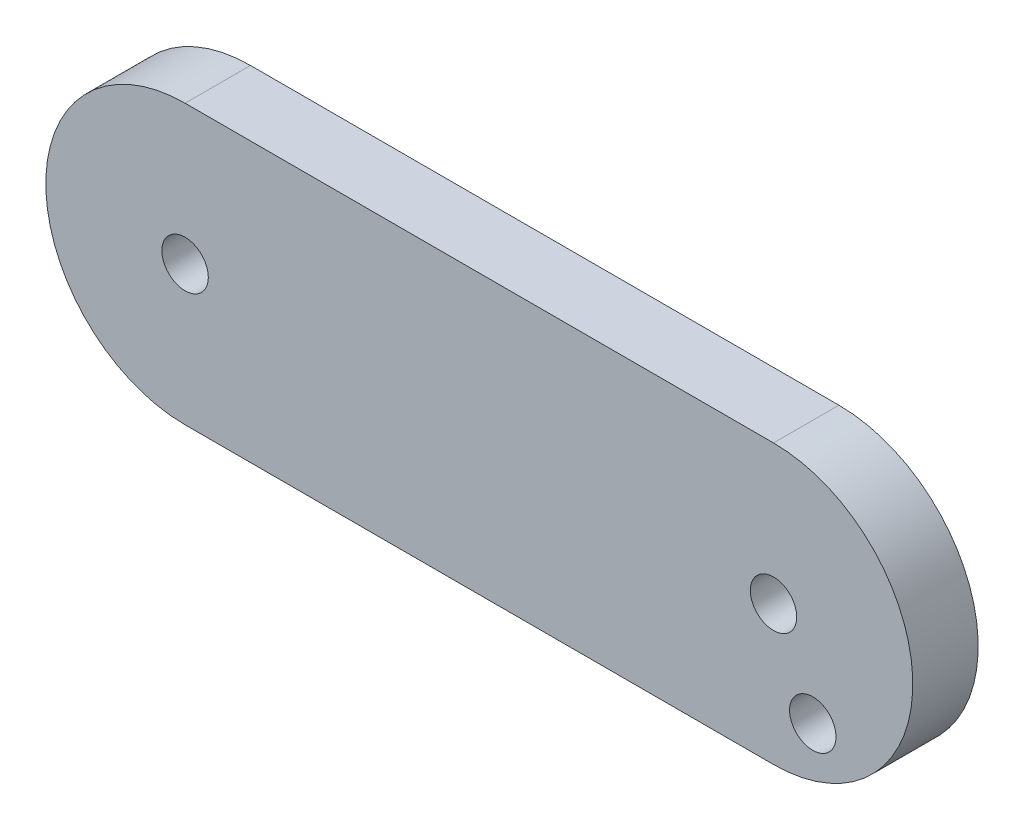
ISO-10303-21;
HEADER;
FILE_DESCRIPTION(('STEP AP214'),'2;1');
FILE_NAME('part.step','',(''),(''),'','','');
FILE_SCHEMA(('AUTOMOTIVE_DESIGN { 1 0 10303 214 1 1 1 1 }'));
ENDSEC;
DATA;
#1=APPLICATION_CONTEXT('core data for automotive mechanical design processes');
#2=APPLICATION_PROTOCOL_DEFINITION('international standard','automotive_design',2000,#1);
#3=PRODUCT_CONTEXT('',#1,'mechanical');
#4=PRODUCT('Part','Part','',(#3));
#5=PRODUCT_RELATED_PRODUCT_CATEGORY('part','',(#4));
#6=PRODUCT_DEFINITION_FORMATION('','',#4);
#7=PRODUCT_DEFINITION_CONTEXT('part definition',#1,'design');
#8=PRODUCT_DEFINITION('design','',#6,#7);
#9=PRODUCT_DEFINITION_SHAPE('','',#8);
#10=(LENGTH_UNIT() NAMED_UNIT(*) SI_UNIT(.MILLI.,.METRE.));
#11=(NAMED_UNIT(*) PLANE_ANGLE_UNIT() SI_UNIT($,.RADIAN.));
#12=(NAMED_UNIT(*) SI_UNIT($,.STERADIAN.) SOLID_ANGLE_UNIT());
#13=UNCERTAINTY_MEASURE_WITH_UNIT(LENGTH_MEASURE(1.E-05),#10,'distance_accuracy_value','');
#14=(GEOMETRIC_REPRESENTATION_CONTEXT(3) GLOBAL_UNCERTAINTY_ASSIGNED_CONTEXT((#13)) GLOBAL_UNIT_ASSIGNED_CONTEXT((#10,
#11,#12)) REPRESENTATION_CONTEXT('',''));
#15=CARTESIAN_POINT('',(0.,0.,0.));
#16=DIRECTION('',(0.,0.,1.));
#17=DIRECTION('',(1.,0.,0.));
#18=AXIS2_PLACEMENT_3D('',#15,#16,#17);
#19=CARTESIAN_POINT('',(-22.5,-1.59594559789866E-13,570.51928881621));
#20=DIRECTION('',(0.,0.,1.));
#21=DIRECTION('',(1.,0.,0.));
#22=AXIS2_PLACEMENT_3D('',#19,#20,#21);
#23=PLANE('',#22);
#24=CARTESIAN_POINT('',(1.50100101049646,-3.21706325188511,570.51928881621));
#25=DIRECTION('',(0.,0.,-1.));
#26=DIRECTION('',(-1.,0.,0.));
#27=AXIS2_PLACEMENT_3D('',#24,#25,#26);
#28=CIRCLE('',#27,0.887499999999999);
#29=CARTESIAN_POINT('',(0.61350101049646,-3.21706325188511,570.51928881621));
#30=VERTEX_POINT('',#29);
#31=EDGE_CURVE('E148',#30,#30,#28,.T.);
#32=ORIENTED_EDGE('',*,*,#31,.T.);
#33=EDGE_LOOP('',(#32));
#34=FACE_BOUND('',#33,.T.);
#35=CARTESIAN_POINT('',(0.,0.,570.51928881621));
#36=DIRECTION('',(0.,0.,1.));
#37=DIRECTION('',(1.,0.,0.));
#38=AXIS2_PLACEMENT_3D('',#35,#36,#37);
#39=CIRCLE('',#38,0.887499999999997);
#40=CARTESIAN_POINT('',(0.887499999999997,0.,570.51928881621));
#41=VERTEX_POINT('',#40);
#42=EDGE_CURVE('E118',#41,#41,#39,.T.);
#43=ORIENTED_EDGE('',*,*,#42,.F.);
#44=EDGE_LOOP('',(#43));
#45=FACE_BOUND('',#44,.T.);
#46=CARTESIAN_POINT('',(-22.5,-1.59594559789866E-13,570.51928881621));
#47=DIRECTION('',(0.,0.,1.));
#48=DIRECTION('',(1.,0.,0.));
#49=AXIS2_PLACEMENT_3D('',#46,#47,#48);
#50=CIRCLE('',#49,5.32499999999984);
#51=CARTESIAN_POINT('',(-22.5,5.32499999999984,570.51928881621));
#52=VERTEX_POINT('',#51);
#53=CARTESIAN_POINT('',(-22.5,-5.32499999999984,570.51928881621));
#54=VERTEX_POINT('',#53);
#55=EDGE_CURVE('E98',#52,#54,#50,.T.);
#56=ORIENTED_EDGE('',*,*,#55,.T.);
#57=DIRECTION('',(1.,0.,0.));
#58=VECTOR('',#57,1.);
#59=CARTESIAN_POINT('',(-22.5,-5.32499999999984,570.51928881621));
#60=LINE('',#59,#58);
#61=CARTESIAN_POINT('',(0.,-5.32499999999984,570.51928881621));
#62=VERTEX_POINT('',#61);
#63=EDGE_CURVE('E93',#54,#62,#60,.T.);
#64=ORIENTED_EDGE('',*,*,#63,.T.);
#65=CARTESIAN_POINT('',(0.,0.,570.51928881621));
#66=DIRECTION('',(0.,0.,1.));
#67=DIRECTION('',(1.,0.,0.));
#68=AXIS2_PLACEMENT_3D('',#65,#66,#67);
#69=CIRCLE('',#68,5.32499999999984);
#70=CARTESIAN_POINT('',(0.,5.32499999999984,570.51928881621));
#71=VERTEX_POINT('',#70);
#72=EDGE_CURVE('E96',#62,#71,#69,.T.);
#73=ORIENTED_EDGE('',*,*,#72,.T.);
#74=DIRECTION('',(-1.,0.,0.));
#75=VECTOR('',#74,1.);
#76=CARTESIAN_POINT('',(-22.5,5.32499999999984,570.51928881621));
#77=LINE('',#76,#75);
#78=EDGE_CURVE('E63',#71,#52,#77,.T.);
#79=ORIENTED_EDGE('',*,*,#78,.T.);
#80=EDGE_LOOP('',(#56,#64,#73,#79));
#81=FACE_BOUND('',#80,.T.);
#82=CARTESIAN_POINT('',(-22.5,-1.59594559789866E-13,570.51928881621));
#83=DIRECTION('',(0.,0.,1.));
#84=DIRECTION('',(1.,0.,0.));
#85=AXIS2_PLACEMENT_3D('',#82,#83,#84);
#86=CIRCLE('',#85,0.887499999999997);
#87=CARTESIAN_POINT('',(-21.6125,-1.59594559789866E-13,570.51928881621));
#88=VERTEX_POINT('',#87);
#89=EDGE_CURVE('E140',#88,#88,#86,.T.);
#90=ORIENTED_EDGE('',*,*,#89,.F.);
#91=EDGE_LOOP('',(#90));
#92=FACE_BOUND('',#91,.T.);
#93=ADVANCED_FACE('F45',(#34,#45,#81,#92),#23,.T.);
#94=CARTESIAN_POINT('',(-22.5,-1.59594559789866E-13,568.01928881621));
#95=DIRECTION('',(0.,0.,1.));
#96=DIRECTION('',(1.,0.,0.));
#97=AXIS2_PLACEMENT_3D('',#94,#95,#96);
#98=PLANE('',#97);
#99=CARTESIAN_POINT('',(1.50100101049646,-3.21706325188511,568.01928881621));
#100=DIRECTION('',(0.,0.,-1.));
#101=DIRECTION('',(-1.,0.,0.));
#102=AXIS2_PLACEMENT_3D('',#99,#100,#101);
#103=CIRCLE('',#102,0.887499999999999);
#104=CARTESIAN_POINT('',(0.61350101049646,-3.21706325188511,568.01928881621));
#105=VERTEX_POINT('',#104);
#106=EDGE_CURVE('E152',#105,#105,#103,.T.);
#107=ORIENTED_EDGE('',*,*,#106,.F.);
#108=EDGE_LOOP('',(#107));
#109=FACE_BOUND('',#108,.T.);
#110=CARTESIAN_POINT('',(-22.5,-1.59594559789866E-13,568.01928881621));
#111=DIRECTION('',(0.,0.,1.));
#112=DIRECTION('',(1.,0.,0.));
#113=AXIS2_PLACEMENT_3D('',#110,#111,#112);
#114=CIRCLE('',#113,5.32499999999984);
#115=CARTESIAN_POINT('',(-22.5,5.32499999999984,568.01928881621));
#116=VERTEX_POINT('',#115);
#117=CARTESIAN_POINT('',(-22.5,-5.32499999999984,568.01928881621));
#118=VERTEX_POINT('',#117);
#119=EDGE_CURVE('E114',#116,#118,#114,.T.);
#120=ORIENTED_EDGE('',*,*,#119,.F.);
#121=DIRECTION('',(-1.,0.,0.));
#122=VECTOR('',#121,1.);
#123=CARTESIAN_POINT('',(-22.5,5.32499999999984,568.01928881621));
#124=LINE('',#123,#122);
#125=CARTESIAN_POINT('',(0.,5.32499999999984,568.01928881621));
#126=VERTEX_POINT('',#125);
#127=EDGE_CURVE('E86',#126,#116,#124,.T.);
#128=ORIENTED_EDGE('',*,*,#127,.F.);
#129=CARTESIAN_POINT('',(0.,0.,568.01928881621));
#130=DIRECTION('',(0.,0.,1.));
#131=DIRECTION('',(1.,0.,0.));
#132=AXIS2_PLACEMENT_3D('',#129,#130,#131);
#133=CIRCLE('',#132,5.32499999999984);
#134=CARTESIAN_POINT('',(0.,-5.32499999999984,568.01928881621));
#135=VERTEX_POINT('',#134);
#136=EDGE_CURVE('E80',#135,#126,#133,.T.);
#137=ORIENTED_EDGE('',*,*,#136,.F.);
#138=DIRECTION('',(1.,0.,0.));
#139=VECTOR('',#138,1.);
#140=CARTESIAN_POINT('',(-22.5,-5.32499999999984,568.01928881621));
#141=LINE('',#140,#139);
#142=EDGE_CURVE('E103',#118,#135,#141,.T.);
#143=ORIENTED_EDGE('',*,*,#142,.F.);
#144=EDGE_LOOP('',(#120,#128,#137,#143));
#145=FACE_BOUND('',#144,.T.);
#146=CARTESIAN_POINT('',(0.,0.,568.01928881621));
#147=DIRECTION('',(0.,0.,1.));
#148=DIRECTION('',(1.,0.,0.));
#149=AXIS2_PLACEMENT_3D('',#146,#147,#148);
#150=CIRCLE('',#149,0.887499999999997);
#151=CARTESIAN_POINT('',(0.887499999999997,0.,568.01928881621));
#152=VERTEX_POINT('',#151);
#153=EDGE_CURVE('E136',#152,#152,#150,.T.);
#154=ORIENTED_EDGE('',*,*,#153,.T.);
#155=EDGE_LOOP('',(#154));
#156=FACE_BOUND('',#155,.T.);
#157=CARTESIAN_POINT('',(-22.5,-1.59594559789866E-13,568.01928881621));
#158=DIRECTION('',(0.,0.,1.));
#159=DIRECTION('',(1.,0.,0.));
#160=AXIS2_PLACEMENT_3D('',#157,#158,#159);
#161=CIRCLE('',#160,0.887499999999997);
#162=CARTESIAN_POINT('',(-21.6125,-1.59594559789866E-13,568.01928881621));
#163=VERTEX_POINT('',#162);
#164=EDGE_CURVE('E144',#163,#163,#161,.T.);
#165=ORIENTED_EDGE('',*,*,#164,.T.);
#166=EDGE_LOOP('',(#165));
#167=FACE_BOUND('',#166,.T.);
#168=ADVANCED_FACE('F131',(#109,#145,#156,#167),#98,.F.);
#169=CARTESIAN_POINT('',(-22.5,-1.59594559789866E-13,570.51928881621));
#170=DIRECTION('',(0.,0.,-1.));
#171=DIRECTION('',(-1.,0.,0.));
#172=AXIS2_PLACEMENT_3D('',#169,#170,#171);
#173=CYLINDRICAL_SURFACE('',#172,5.32499999999984);
#174=ORIENTED_EDGE('',*,*,#119,.T.);
#175=DIRECTION('',(0.,0.,-1.));
#176=VECTOR('',#175,1.);
#177=CARTESIAN_POINT('',(-22.5,-5.32499999999984,570.51928881621));
#178=LINE('',#177,#176);
#179=EDGE_CURVE('E11',#54,#118,#178,.T.);
#180=ORIENTED_EDGE('',*,*,#179,.F.);
#181=ORIENTED_EDGE('',*,*,#55,.F.);
#182=DIRECTION('',(0.,0.,-1.));
#183=VECTOR('',#182,1.);
#184=CARTESIAN_POINT('',(-22.5,5.32499999999984,570.51928881621));
#185=LINE('',#184,#183);
#186=EDGE_CURVE('E110',#52,#116,#185,.T.);
#187=ORIENTED_EDGE('',*,*,#186,.T.);
#188=EDGE_LOOP('',(#174,#180,#181,#187));
#189=FACE_BOUND('',#188,.T.);
#190=ADVANCED_FACE('F47',(#189),#173,.T.);
#191=CARTESIAN_POINT('',(-22.5,-5.32499999999984,570.51928881621));
#192=DIRECTION('',(0.,1.,0.));
#193=DIRECTION('',(0.,0.,1.));
#194=AXIS2_PLACEMENT_3D('',#191,#192,#193);
#195=PLANE('',#194);
#196=ORIENTED_EDGE('',*,*,#142,.T.);
#197=DIRECTION('',(0.,0.,-1.));
#198=VECTOR('',#197,1.);
#199=CARTESIAN_POINT('',(0.,-5.32499999999984,570.51928881621));
#200=LINE('',#199,#198);
#201=EDGE_CURVE('E55',#62,#135,#200,.T.);
#202=ORIENTED_EDGE('',*,*,#201,.F.);
#203=ORIENTED_EDGE('',*,*,#63,.F.);
#204=ORIENTED_EDGE('',*,*,#179,.T.);
#205=EDGE_LOOP('',(#196,#202,#203,#204));
#206=FACE_BOUND('',#205,.T.);
#207=ADVANCED_FACE('F102',(#206),#195,.F.);
#208=CARTESIAN_POINT('',(0.,0.,570.51928881621));
#209=DIRECTION('',(0.,0.,-1.));
#210=DIRECTION('',(-1.,0.,0.));
#211=AXIS2_PLACEMENT_3D('',#208,#209,#210);
#212=CYLINDRICAL_SURFACE('',#211,5.32499999999984);
#213=ORIENTED_EDGE('',*,*,#136,.T.);
#214=DIRECTION('',(0.,0.,-1.));
#215=VECTOR('',#214,1.);
#216=CARTESIAN_POINT('',(0.,5.32499999999984,570.51928881621));
#217=LINE('',#216,#215);
#218=EDGE_CURVE('E105',#71,#126,#217,.T.);
#219=ORIENTED_EDGE('',*,*,#218,.F.);
#220=ORIENTED_EDGE('',*,*,#72,.F.);
#221=ORIENTED_EDGE('',*,*,#201,.T.);
#222=EDGE_LOOP('',(#213,#219,#220,#221));
#223=FACE_BOUND('',#222,.T.);
#224=ADVANCED_FACE('F106',(#223),#212,.T.);
#225=CARTESIAN_POINT('',(-22.5,5.32499999999984,570.51928881621));
#226=DIRECTION('',(0.,-1.,0.));
#227=DIRECTION('',(0.,0.,-1.));
#228=AXIS2_PLACEMENT_3D('',#225,#226,#227);
#229=PLANE('',#228);
#230=ORIENTED_EDGE('',*,*,#127,.T.);
#231=ORIENTED_EDGE('',*,*,#186,.F.);
#232=ORIENTED_EDGE('',*,*,#78,.F.);
#233=ORIENTED_EDGE('',*,*,#218,.T.);
#234=EDGE_LOOP('',(#230,#231,#232,#233));
#235=FACE_BOUND('',#234,.T.);
#236=ADVANCED_FACE('F128',(#235),#229,.F.);
#237=CARTESIAN_POINT('',(0.,0.,570.51928881621));
#238=DIRECTION('',(0.,0.,-1.));
#239=DIRECTION('',(-1.,0.,0.));
#240=AXIS2_PLACEMENT_3D('',#237,#238,#239);
#241=CYLINDRICAL_SURFACE('',#240,0.887499999999997);
#242=ORIENTED_EDGE('',*,*,#42,.T.);
#243=EDGE_LOOP('',(#242));
#244=FACE_BOUND('',#243,.T.);
#245=ORIENTED_EDGE('',*,*,#153,.F.);
#246=EDGE_LOOP('',(#245));
#247=FACE_BOUND('',#246,.T.);
#248=ADVANCED_FACE('F180',(#244,#247),#241,.F.);
#249=CARTESIAN_POINT('',(-22.5,-1.59594559789866E-13,570.51928881621));
#250=DIRECTION('',(0.,0.,-1.));
#251=DIRECTION('',(-1.,0.,0.));
#252=AXIS2_PLACEMENT_3D('',#249,#250,#251);
#253=CYLINDRICAL_SURFACE('',#252,0.887499999999997);
#254=ORIENTED_EDGE('',*,*,#89,.T.);
#255=EDGE_LOOP('',(#254));
#256=FACE_BOUND('',#255,.T.);
#257=ORIENTED_EDGE('',*,*,#164,.F.);
#258=EDGE_LOOP('',(#257));
#259=FACE_BOUND('',#258,.T.);
#260=ADVANCED_FACE('F165',(#256,#259),#253,.F.);
#261=CARTESIAN_POINT('',(1.50100101049646,-3.21706325188511,570.51928881621));
#262=DIRECTION('',(0.,0.,-1.));
#263=DIRECTION('',(-1.,0.,0.));
#264=AXIS2_PLACEMENT_3D('',#261,#262,#263);
#265=CYLINDRICAL_SURFACE('',#264,0.887499999999999);
#266=ORIENTED_EDGE('',*,*,#31,.F.);
#267=EDGE_LOOP('',(#266));
#268=FACE_BOUND('',#267,.T.);
#269=ORIENTED_EDGE('',*,*,#106,.T.);
#270=EDGE_LOOP('',(#269));
#271=FACE_BOUND('',#270,.T.);
#272=ADVANCED_FACE('F162',(#268,#271),#265,.F.);
#273=CLOSED_SHELL('',(#93,#168,#190,#207,#224,#236,#248,#260,#272));
#274=MANIFOLD_SOLID_BREP('B2',#273);
#275=ADVANCED_BREP_SHAPE_REPRESENTATION('',(#18,#274),#14);
#276=SHAPE_DEFINITION_REPRESENTATION(#9,#275);
ENDSEC;
END-ISO-10303-21;
